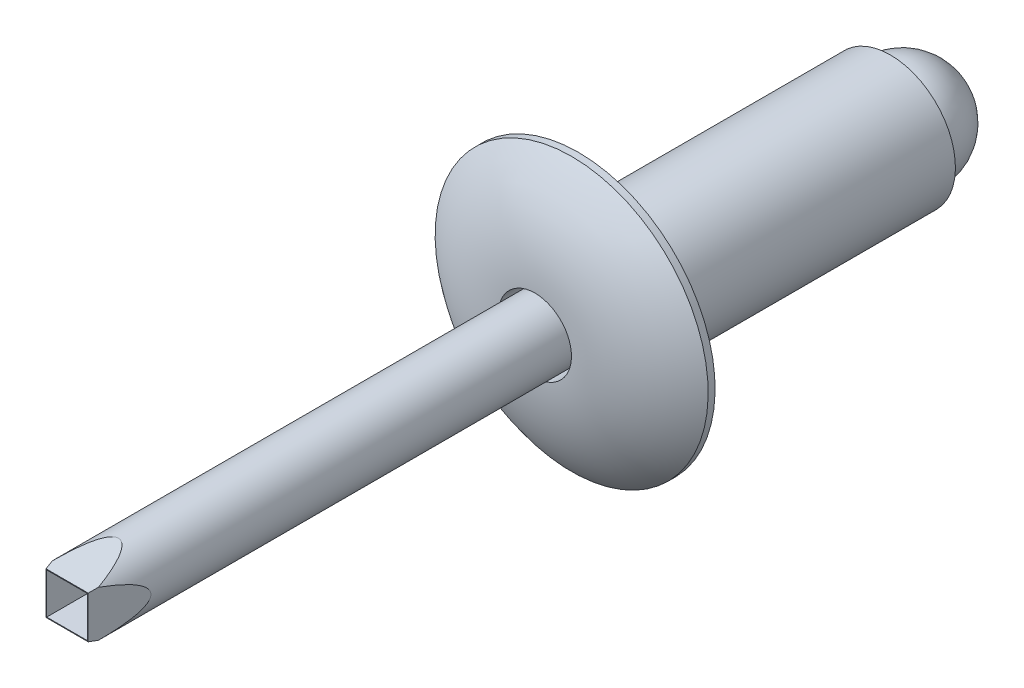
ISO-10303-21;
HEADER;
FILE_DESCRIPTION(('STEP AP214'),'2;1');
FILE_NAME('part.step','',(''),(''),'','','');
FILE_SCHEMA(('AUTOMOTIVE_DESIGN { 1 0 10303 214 1 1 1 1 }'));
ENDSEC;
DATA;
#1=APPLICATION_CONTEXT('core data for automotive mechanical design processes');
#2=APPLICATION_PROTOCOL_DEFINITION('international standard','automotive_design',2000,#1);
#3=PRODUCT_CONTEXT('',#1,'mechanical');
#4=PRODUCT('Part','Part','',(#3));
#5=PRODUCT_RELATED_PRODUCT_CATEGORY('part','',(#4));
#6=PRODUCT_DEFINITION_FORMATION('','',#4);
#7=PRODUCT_DEFINITION_CONTEXT('part definition',#1,'design');
#8=PRODUCT_DEFINITION('design','',#6,#7);
#9=PRODUCT_DEFINITION_SHAPE('','',#8);
#10=(LENGTH_UNIT() NAMED_UNIT(*) SI_UNIT(.MILLI.,.METRE.));
#11=(NAMED_UNIT(*) PLANE_ANGLE_UNIT() SI_UNIT($,.RADIAN.));
#12=(NAMED_UNIT(*) SI_UNIT($,.STERADIAN.) SOLID_ANGLE_UNIT());
#13=UNCERTAINTY_MEASURE_WITH_UNIT(LENGTH_MEASURE(1.E-05),#10,'distance_accuracy_value','');
#14=(GEOMETRIC_REPRESENTATION_CONTEXT(3) GLOBAL_UNCERTAINTY_ASSIGNED_CONTEXT((#13)) GLOBAL_UNIT_ASSIGNED_CONTEXT((#10,
#11,#12)) REPRESENTATION_CONTEXT('',''));
#15=CARTESIAN_POINT('',(0.,0.,0.));
#16=DIRECTION('',(0.,0.,1.));
#17=DIRECTION('',(1.,0.,0.));
#18=AXIS2_PLACEMENT_3D('',#15,#16,#17);
#19=CARTESIAN_POINT('',(0.,0.,-11.8741976190476));
#20=DIRECTION('',(0.,0.,1.));
#21=DIRECTION('',(0.,1.,0.));
#22=AXIS2_PLACEMENT_3D('',#19,#20,#21);
#23=SPHERICAL_SURFACE('',#22,1.95610238095238);
#24=CARTESIAN_POINT('',(0.,0.,-11.43));
#25=DIRECTION('',(0.,0.,1.));
#26=DIRECTION('',(1.,0.,0.));
#27=AXIS2_PLACEMENT_3D('',#24,#25,#26);
#28=CIRCLE('',#27,1.905);
#29=CARTESIAN_POINT('',(1.905,0.,-11.43));
#30=VERTEX_POINT('',#29);
#31=EDGE_CURVE('E11',#30,#30,#28,.T.);
#32=ORIENTED_EDGE('',*,*,#31,.F.);
#33=EDGE_LOOP('',(#32));
#34=FACE_BOUND('',#33,.T.);
#35=ADVANCED_FACE('F51',(#34),#23,.T.);
#36=CARTESIAN_POINT('',(0.,1.905,-11.43));
#37=DIRECTION('',(0.,0.,-1.));
#38=DIRECTION('',(-1.,0.,0.));
#39=AXIS2_PLACEMENT_3D('',#36,#37,#38);
#40=PLANE('',#39);
#41=ORIENTED_EDGE('',*,*,#31,.T.);
#42=EDGE_LOOP('',(#41));
#43=FACE_BOUND('',#42,.T.);
#44=ADVANCED_FACE('F58',(#43),#40,.F.);
#45=CLOSED_SHELL('',(#35,#44));
#46=MANIFOLD_SOLID_BREP('B2',#45);
#47=CARTESIAN_POINT('',(0.,0.,18.7452));
#48=DIRECTION('',(0.,0.,-1.));
#49=DIRECTION('',(-1.,0.,0.));
#50=AXIS2_PLACEMENT_3D('',#47,#48,#49);
#51=PLANE('',#50);
#52=DIRECTION('',(1.,0.,0.));
#53=VECTOR('',#52,1.);
#54=CARTESIAN_POINT('',(-0.74850625,-0.748506249999997,18.7452));
#55=LINE('',#54,#53);
#56=CARTESIAN_POINT('',(-0.74850625,-0.748506249999997,18.7452));
#57=VERTEX_POINT('',#56);
#58=CARTESIAN_POINT('',(0.74850625,-0.748506250000003,18.7452));
#59=VERTEX_POINT('',#58);
#60=EDGE_CURVE('E175',#57,#59,#55,.T.);
#61=ORIENTED_EDGE('',*,*,#60,.F.);
#62=DIRECTION('',(0.,-1.,0.));
#63=VECTOR('',#62,1.);
#64=CARTESIAN_POINT('',(-0.74850625,0.748506250000003,18.7452));
#65=LINE('',#64,#63);
#66=CARTESIAN_POINT('',(-0.74850625,0.748506250000003,18.7452));
#67=VERTEX_POINT('',#66);
#68=EDGE_CURVE('E97',#67,#57,#65,.T.);
#69=ORIENTED_EDGE('',*,*,#68,.F.);
#70=DIRECTION('',(-1.,0.,0.));
#71=VECTOR('',#70,1.);
#72=CARTESIAN_POINT('',(0.74850625,0.748506250000005,18.7452));
#73=LINE('',#72,#71);
#74=CARTESIAN_POINT('',(0.74850625,0.748506250000005,18.7452));
#75=VERTEX_POINT('',#74);
#76=EDGE_CURVE('E166',#75,#67,#73,.T.);
#77=ORIENTED_EDGE('',*,*,#76,.F.);
#78=DIRECTION('',(0.,1.,0.));
#79=VECTOR('',#78,1.);
#80=CARTESIAN_POINT('',(0.74850625,-0.748506250000003,18.7452));
#81=LINE('',#80,#79);
#82=EDGE_CURVE('E169',#59,#75,#81,.T.);
#83=ORIENTED_EDGE('',*,*,#82,.F.);
#84=EDGE_LOOP('',(#61,#69,#77,#83));
#85=FACE_BOUND('',#84,.T.);
#86=DIRECTION('',(0.,1.,0.));
#87=VECTOR('',#86,1.);
#88=CARTESIAN_POINT('',(-0.77390625,-5.0038,18.7452));
#89=LINE('',#88,#87);
#90=CARTESIAN_POINT('',(-0.77390625,-0.773906249999997,18.7452));
#91=VERTEX_POINT('',#90);
#92=CARTESIAN_POINT('',(-0.77390625,0.773906250000003,18.7452));
#93=VERTEX_POINT('',#92);
#94=EDGE_CURVE('E200',#91,#93,#89,.T.);
#95=ORIENTED_EDGE('',*,*,#94,.F.);
#96=DIRECTION('',(1.,0.,0.));
#97=VECTOR('',#96,1.);
#98=CARTESIAN_POINT('',(-1.19062500000001,-0.773906249999996,18.7452));
#99=LINE('',#98,#97);
#100=CARTESIAN_POINT('',(0.77390625,-0.773906250000003,18.7452));
#101=VERTEX_POINT('',#100);
#102=EDGE_CURVE('E181',#91,#101,#99,.T.);
#103=ORIENTED_EDGE('',*,*,#102,.T.);
#104=DIRECTION('',(0.,1.,0.));
#105=VECTOR('',#104,1.);
#106=CARTESIAN_POINT('',(0.77390625,-5.0038,18.7452));
#107=LINE('',#106,#105);
#108=CARTESIAN_POINT('',(0.77390625,0.773906250000005,18.7452));
#109=VERTEX_POINT('',#108);
#110=EDGE_CURVE('E199',#101,#109,#107,.T.);
#111=ORIENTED_EDGE('',*,*,#110,.T.);
#112=DIRECTION('',(1.,0.,0.));
#113=VECTOR('',#112,1.);
#114=CARTESIAN_POINT('',(-1.190625,0.773906250000004,18.7452));
#115=LINE('',#114,#113);
#116=EDGE_CURVE('E185',#93,#109,#115,.T.);
#117=ORIENTED_EDGE('',*,*,#116,.F.);
#118=EDGE_LOOP('',(#95,#103,#111,#117));
#119=FACE_BOUND('',#118,.T.);
#120=ADVANCED_FACE('F83',(#85,#119),#51,.F.);
#121=CARTESIAN_POINT('',(0.,0.,18.7452));
#122=DIRECTION('',(0.,0.,1.));
#123=DIRECTION('',(1.,0.,0.));
#124=AXIS2_PLACEMENT_3D('',#121,#122,#123);
#125=CYLINDRICAL_SURFACE('',#124,1.190625);
#126=CARTESIAN_POINT('',(0.,0.,22.2360655029123));
#127=DIRECTION('',(-0.976296007119934,0.,-0.216439613938101));
#128=DIRECTION('',(-0.216439613938101,0.,0.976296007119934));
#129=AXIS2_PLACEMENT_3D('',#126,#127,#128);
#130=ELLIPSE('',#129,5.50095695670805,1.190625);
#131=CARTESIAN_POINT('',(0.841899011350235,0.841899011350231,18.43850447319));
#132=VERTEX_POINT('',#131);
#133=CARTESIAN_POINT('',(0.841899011350232,-0.841899011350234,18.43850447319));
#134=VERTEX_POINT('',#133);
#135=EDGE_CURVE('E211',#132,#134,#130,.T.);
#136=ORIENTED_EDGE('',*,*,#135,.T.);
#137=CARTESIAN_POINT('',(0.,0.,22.2360655029123));
#138=DIRECTION('',(0.,0.976296007119934,-0.216439613938101));
#139=DIRECTION('',(0.,0.216439613938101,0.976296007119934));
#140=AXIS2_PLACEMENT_3D('',#137,#138,#139);
#141=ELLIPSE('',#140,5.50095695670805,1.190625);
#142=CARTESIAN_POINT('',(-0.841899011350235,-0.841899011350232,18.43850447319));
#143=VERTEX_POINT('',#142);
#144=EDGE_CURVE('E105',#134,#143,#141,.T.);
#145=ORIENTED_EDGE('',*,*,#144,.T.);
#146=CARTESIAN_POINT('',(0.,0.,22.2360655029123));
#147=DIRECTION('',(0.976296007119934,0.,-0.2164396139381));
#148=DIRECTION('',(0.2164396139381,0.,0.976296007119934));
#149=AXIS2_PLACEMENT_3D('',#146,#147,#148);
#150=ELLIPSE('',#149,5.50095695670806,1.190625);
#151=CARTESIAN_POINT('',(-0.841899011350232,0.841899011350234,18.43850447319));
#152=VERTEX_POINT('',#151);
#153=EDGE_CURVE('E208',#143,#152,#150,.T.);
#154=ORIENTED_EDGE('',*,*,#153,.T.);
#155=CARTESIAN_POINT('',(0.,0.,22.2360655029123));
#156=DIRECTION('',(0.,-0.976296007119934,-0.216439613938101));
#157=DIRECTION('',(0.,-0.2164396139381,0.976296007119934));
#158=AXIS2_PLACEMENT_3D('',#155,#156,#157);
#159=ELLIPSE('',#158,5.50095695670806,1.190625);
#160=EDGE_CURVE('E187',#152,#132,#159,.T.);
#161=ORIENTED_EDGE('',*,*,#160,.T.);
#162=EDGE_LOOP('',(#136,#145,#154,#161));
#163=FACE_BOUND('',#162,.T.);
#164=CARTESIAN_POINT('',(0.,0.,-1.143));
#165=DIRECTION('',(0.,0.,1.));
#166=DIRECTION('',(1.,0.,0.));
#167=AXIS2_PLACEMENT_3D('',#164,#165,#166);
#168=CIRCLE('',#167,1.190625);
#169=CARTESIAN_POINT('',(1.190625,0.,-1.143));
#170=VERTEX_POINT('',#169);
#171=EDGE_CURVE('E203',#170,#170,#168,.T.);
#172=ORIENTED_EDGE('',*,*,#171,.T.);
#173=EDGE_LOOP('',(#172));
#174=FACE_BOUND('',#173,.T.);
#175=ADVANCED_FACE('F227',(#163,#174),#125,.T.);
#176=CARTESIAN_POINT('',(0.,1.190625,-1.143));
#177=DIRECTION('',(0.,0.,1.));
#178=DIRECTION('',(1.,0.,0.));
#179=AXIS2_PLACEMENT_3D('',#176,#177,#178);
#180=PLANE('',#179);
#181=ORIENTED_EDGE('',*,*,#171,.F.);
#182=EDGE_LOOP('',(#181));
#183=FACE_BOUND('',#182,.T.);
#184=ADVANCED_FACE('F244',(#183),#180,.F.);
#185=CARTESIAN_POINT('',(-1.393825,-5.0038,15.9489272227954));
#186=DIRECTION('',(0.976296007119934,0.,-0.2164396139381));
#187=DIRECTION('',(-0.2164396139381,0.,-0.976296007119934));
#188=AXIS2_PLACEMENT_3D('',#185,#186,#187);
#189=PLANE('',#188);
#190=ORIENTED_EDGE('',*,*,#153,.F.);
#191=DIRECTION('',(0.211541378239843,0.211541378239843,0.954201493702863));
#192=VECTOR('',#191,1.);
#193=CARTESIAN_POINT('',(-1.55537049575061,-1.55537049575061,15.2202425813848));
#194=LINE('',#193,#192);
#195=EDGE_CURVE('E196',#143,#91,#194,.T.);
#196=ORIENTED_EDGE('',*,*,#195,.T.);
#197=ORIENTED_EDGE('',*,*,#94,.T.);
#198=DIRECTION('',(-0.211541378239843,0.211541378239844,-0.954201493702863));
#199=VECTOR('',#198,1.);
#200=CARTESIAN_POINT('',(-1.10753285053871,1.10753285053871,17.2403076559022));
#201=LINE('',#200,#199);
#202=EDGE_CURVE('E192',#93,#152,#201,.T.);
#203=ORIENTED_EDGE('',*,*,#202,.T.);
#204=EDGE_LOOP('',(#190,#196,#197,#203));
#205=FACE_BOUND('',#204,.T.);
#206=ADVANCED_FACE('F225',(#205),#189,.F.);
#207=CARTESIAN_POINT('',(0.77390625,-5.0038,18.7452));
#208=DIRECTION('',(-0.976296007119934,0.,-0.216439613938101));
#209=DIRECTION('',(-0.216439613938101,0.,0.976296007119934));
#210=AXIS2_PLACEMENT_3D('',#207,#208,#209);
#211=PLANE('',#210);
#212=ORIENTED_EDGE('',*,*,#110,.F.);
#213=DIRECTION('',(0.211541378239843,-0.211541378239844,-0.954201493702863));
#214=VECTOR('',#213,1.);
#215=CARTESIAN_POINT('',(0.963192957751764,-0.963192957751767,17.8913828377139));
#216=LINE('',#215,#214);
#217=EDGE_CURVE('E49',#101,#134,#216,.T.);
#218=ORIENTED_EDGE('',*,*,#217,.T.);
#219=ORIENTED_EDGE('',*,*,#135,.F.);
#220=DIRECTION('',(-0.211541378239843,-0.211541378239842,0.954201493702863));
#221=VECTOR('',#220,1.);
#222=CARTESIAN_POINT('',(0.515355312539862,0.51535531253986,19.9114479122313));
#223=LINE('',#222,#221);
#224=EDGE_CURVE('E90',#132,#109,#223,.T.);
#225=ORIENTED_EDGE('',*,*,#224,.T.);
#226=EDGE_LOOP('',(#212,#218,#219,#225));
#227=FACE_BOUND('',#226,.T.);
#228=ADVANCED_FACE('F217',(#227),#211,.F.);
#229=CARTESIAN_POINT('',(-1.190625,1.393825,15.9489272227954));
#230=DIRECTION('',(0.,-0.976296007119934,-0.216439613938101));
#231=DIRECTION('',(0.,0.216439613938101,-0.976296007119934));
#232=AXIS2_PLACEMENT_3D('',#229,#230,#231);
#233=PLANE('',#232);
#234=ORIENTED_EDGE('',*,*,#116,.T.);
#235=ORIENTED_EDGE('',*,*,#224,.F.);
#236=ORIENTED_EDGE('',*,*,#160,.F.);
#237=ORIENTED_EDGE('',*,*,#202,.F.);
#238=EDGE_LOOP('',(#234,#235,#236,#237));
#239=FACE_BOUND('',#238,.T.);
#240=ADVANCED_FACE('F229',(#239),#233,.F.);
#241=CARTESIAN_POINT('',(-1.19062500000001,-0.773906249999996,18.7452));
#242=DIRECTION('',(0.,0.976296007119934,-0.216439613938101));
#243=DIRECTION('',(0.,0.216439613938101,0.976296007119934));
#244=AXIS2_PLACEMENT_3D('',#241,#242,#243);
#245=PLANE('',#244);
#246=ORIENTED_EDGE('',*,*,#144,.F.);
#247=ORIENTED_EDGE('',*,*,#217,.F.);
#248=ORIENTED_EDGE('',*,*,#102,.F.);
#249=ORIENTED_EDGE('',*,*,#195,.F.);
#250=EDGE_LOOP('',(#246,#247,#248,#249));
#251=FACE_BOUND('',#250,.T.);
#252=ADVANCED_FACE('F222',(#251),#245,.F.);
#253=CARTESIAN_POINT('',(-0.74850625,0.748506250000003,16.2052));
#254=DIRECTION('',(-1.,0.,0.));
#255=DIRECTION('',(0.,0.,1.));
#256=AXIS2_PLACEMENT_3D('',#253,#254,#255);
#257=PLANE('',#256);
#258=ORIENTED_EDGE('',*,*,#68,.T.);
#259=DIRECTION('',(0.,0.,1.));
#260=VECTOR('',#259,1.);
#261=CARTESIAN_POINT('',(-0.74850625,-0.748506249999997,16.2052));
#262=LINE('',#261,#260);
#263=CARTESIAN_POINT('',(-0.74850625,-0.748506249999997,16.2052));
#264=VERTEX_POINT('',#263);
#265=EDGE_CURVE('E144',#264,#57,#262,.T.);
#266=ORIENTED_EDGE('',*,*,#265,.F.);
#267=DIRECTION('',(0.,-1.,0.));
#268=VECTOR('',#267,1.);
#269=CARTESIAN_POINT('',(-0.74850625,0.748506250000003,16.2052));
#270=LINE('',#269,#268);
#271=CARTESIAN_POINT('',(-0.74850625,0.748506250000003,16.2052));
#272=VERTEX_POINT('',#271);
#273=EDGE_CURVE('E148',#272,#264,#270,.T.);
#274=ORIENTED_EDGE('',*,*,#273,.F.);
#275=DIRECTION('',(0.,0.,1.));
#276=VECTOR('',#275,1.);
#277=CARTESIAN_POINT('',(-0.74850625,0.748506250000003,16.2052));
#278=LINE('',#277,#276);
#279=EDGE_CURVE('E179',#272,#67,#278,.T.);
#280=ORIENTED_EDGE('',*,*,#279,.T.);
#281=EDGE_LOOP('',(#258,#266,#274,#280));
#282=FACE_BOUND('',#281,.T.);
#283=ADVANCED_FACE('F146',(#282),#257,.F.);
#284=CARTESIAN_POINT('',(0.74850625,0.748506250000005,16.2052));
#285=DIRECTION('',(0.,1.,0.));
#286=DIRECTION('',(-1.,0.,0.));
#287=AXIS2_PLACEMENT_3D('',#284,#285,#286);
#288=PLANE('',#287);
#289=ORIENTED_EDGE('',*,*,#76,.T.);
#290=ORIENTED_EDGE('',*,*,#279,.F.);
#291=DIRECTION('',(-1.,0.,0.));
#292=VECTOR('',#291,1.);
#293=CARTESIAN_POINT('',(0.74850625,0.748506250000005,16.2052));
#294=LINE('',#293,#292);
#295=CARTESIAN_POINT('',(0.74850625,0.748506250000005,16.2052));
#296=VERTEX_POINT('',#295);
#297=EDGE_CURVE('E154',#296,#272,#294,.T.);
#298=ORIENTED_EDGE('',*,*,#297,.F.);
#299=DIRECTION('',(0.,0.,1.));
#300=VECTOR('',#299,1.);
#301=CARTESIAN_POINT('',(0.74850625,0.748506250000005,16.2052));
#302=LINE('',#301,#300);
#303=EDGE_CURVE('E182',#296,#75,#302,.T.);
#304=ORIENTED_EDGE('',*,*,#303,.T.);
#305=EDGE_LOOP('',(#289,#290,#298,#304));
#306=FACE_BOUND('',#305,.T.);
#307=ADVANCED_FACE('F250',(#306),#288,.F.);
#308=CARTESIAN_POINT('',(0.74850625,-0.748506250000003,16.2052));
#309=DIRECTION('',(1.,0.,0.));
#310=DIRECTION('',(0.,0.,-1.));
#311=AXIS2_PLACEMENT_3D('',#308,#309,#310);
#312=PLANE('',#311);
#313=ORIENTED_EDGE('',*,*,#82,.T.);
#314=ORIENTED_EDGE('',*,*,#303,.F.);
#315=DIRECTION('',(0.,1.,0.));
#316=VECTOR('',#315,1.);
#317=CARTESIAN_POINT('',(0.74850625,-0.748506250000003,16.2052));
#318=LINE('',#317,#316);
#319=CARTESIAN_POINT('',(0.74850625,-0.748506250000003,16.2052));
#320=VERTEX_POINT('',#319);
#321=EDGE_CURVE('E162',#320,#296,#318,.T.);
#322=ORIENTED_EDGE('',*,*,#321,.F.);
#323=DIRECTION('',(0.,0.,1.));
#324=VECTOR('',#323,1.);
#325=CARTESIAN_POINT('',(0.74850625,-0.748506250000003,16.2052));
#326=LINE('',#325,#324);
#327=EDGE_CURVE('E153',#320,#59,#326,.T.);
#328=ORIENTED_EDGE('',*,*,#327,.T.);
#329=EDGE_LOOP('',(#313,#314,#322,#328));
#330=FACE_BOUND('',#329,.T.);
#331=ADVANCED_FACE('F248',(#330),#312,.F.);
#332=CARTESIAN_POINT('',(-0.74850625,-0.748506249999997,16.2052));
#333=DIRECTION('',(0.,-1.,0.));
#334=DIRECTION('',(1.,0.,0.));
#335=AXIS2_PLACEMENT_3D('',#332,#333,#334);
#336=PLANE('',#335);
#337=ORIENTED_EDGE('',*,*,#60,.T.);
#338=ORIENTED_EDGE('',*,*,#327,.F.);
#339=DIRECTION('',(1.,0.,0.));
#340=VECTOR('',#339,1.);
#341=CARTESIAN_POINT('',(-0.74850625,-0.748506249999997,16.2052));
#342=LINE('',#341,#340);
#343=EDGE_CURVE('E157',#264,#320,#342,.T.);
#344=ORIENTED_EDGE('',*,*,#343,.F.);
#345=ORIENTED_EDGE('',*,*,#265,.T.);
#346=EDGE_LOOP('',(#337,#338,#344,#345));
#347=FACE_BOUND('',#346,.T.);
#348=ADVANCED_FACE('F158',(#347),#336,.F.);
#349=CARTESIAN_POINT('',(0.,0.,16.2052));
#350=DIRECTION('',(0.,0.,1.));
#351=DIRECTION('',(1.,0.,0.));
#352=AXIS2_PLACEMENT_3D('',#349,#350,#351);
#353=PLANE('',#352);
#354=ORIENTED_EDGE('',*,*,#273,.T.);
#355=ORIENTED_EDGE('',*,*,#343,.T.);
#356=ORIENTED_EDGE('',*,*,#321,.T.);
#357=ORIENTED_EDGE('',*,*,#297,.T.);
#358=EDGE_LOOP('',(#354,#355,#356,#357));
#359=FACE_BOUND('',#358,.T.);
#360=ADVANCED_FACE('F164',(#359),#353,.T.);
#361=CLOSED_SHELL('',(#120,#175,#184,#206,#228,#240,#252,#283,#307,#331,#348,#360));
#362=MANIFOLD_SOLID_BREP('B6',#361);
#363=CARTESIAN_POINT('',(0.,0.,-11.43));
#364=DIRECTION('',(0.,0.,-1.));
#365=DIRECTION('',(0.,1.,0.));
#366=AXIS2_PLACEMENT_3D('',#363,#364,#365);
#367=CYLINDRICAL_SURFACE('',#366,5.0038);
#368=CARTESIAN_POINT('',(0.,0.,0.254000000000001));
#369=DIRECTION('',(0.,0.,-1.));
#370=DIRECTION('',(0.,1.,0.));
#371=AXIS2_PLACEMENT_3D('',#368,#369,#370);
#372=CIRCLE('',#371,5.0038);
#373=CARTESIAN_POINT('',(0.,5.0038,0.254000000000001));
#374=VERTEX_POINT('',#373);
#375=EDGE_CURVE('E350',#374,#374,#372,.T.);
#376=ORIENTED_EDGE('',*,*,#375,.T.);
#377=EDGE_LOOP('',(#376));
#378=FACE_BOUND('',#377,.T.);
#379=CARTESIAN_POINT('',(0.,0.,0.));
#380=DIRECTION('',(0.,0.,-1.));
#381=DIRECTION('',(0.,1.,0.));
#382=AXIS2_PLACEMENT_3D('',#379,#380,#381);
#383=CIRCLE('',#382,5.0038);
#384=CARTESIAN_POINT('',(0.,5.0038,0.));
#385=VERTEX_POINT('',#384);
#386=EDGE_CURVE('E369',#385,#385,#383,.T.);
#387=ORIENTED_EDGE('',*,*,#386,.F.);
#388=EDGE_LOOP('',(#387));
#389=FACE_BOUND('',#388,.T.);
#390=ADVANCED_FACE('F337',(#378,#389),#367,.T.);
#391=CARTESIAN_POINT('',(0.,0.,-4.06006313338369));
#392=DIRECTION('',(0.,0.,-1.));
#393=DIRECTION('',(0.,1.,0.));
#394=AXIS2_PLACEMENT_3D('',#391,#392,#393);
#395=DEGENERATE_TOROIDAL_SURFACE('',#394,1.339453125,5.66026313338369,.T.);
#396=CARTESIAN_POINT('',(0.,0.,1.6002));
#397=DIRECTION('',(0.,0.,-1.));
#398=DIRECTION('',(0.,1.,0.));
#399=AXIS2_PLACEMENT_3D('',#396,#397,#398);
#400=CIRCLE('',#399,1.339453125);
#401=CARTESIAN_POINT('',(0.,1.339453125,1.6002));
#402=VERTEX_POINT('',#401);
#403=EDGE_CURVE('E355',#402,#402,#400,.T.);
#404=ORIENTED_EDGE('',*,*,#403,.T.);
#405=EDGE_LOOP('',(#404));
#406=FACE_BOUND('',#405,.T.);
#407=ORIENTED_EDGE('',*,*,#375,.F.);
#408=EDGE_LOOP('',(#407));
#409=FACE_BOUND('',#408,.T.);
#410=ADVANCED_FACE('F377',(#406,#409),#395,.T.);
#411=CARTESIAN_POINT('',(0.,0.,-11.43));
#412=DIRECTION('',(0.,0.,-1.));
#413=DIRECTION('',(0.,1.,0.));
#414=AXIS2_PLACEMENT_3D('',#411,#412,#413);
#415=CYLINDRICAL_SURFACE('',#414,1.339453125);
#416=CARTESIAN_POINT('',(0.,0.,-1.143));
#417=DIRECTION('',(0.,0.,-1.));
#418=DIRECTION('',(0.,1.,0.));
#419=AXIS2_PLACEMENT_3D('',#416,#417,#418);
#420=CIRCLE('',#419,1.339453125);
#421=CARTESIAN_POINT('',(0.,1.339453125,-1.143));
#422=VERTEX_POINT('',#421);
#423=EDGE_CURVE('E361',#422,#422,#420,.T.);
#424=ORIENTED_EDGE('',*,*,#423,.T.);
#425=EDGE_LOOP('',(#424));
#426=FACE_BOUND('',#425,.T.);
#427=ORIENTED_EDGE('',*,*,#403,.F.);
#428=EDGE_LOOP('',(#427));
#429=FACE_BOUND('',#428,.T.);
#430=ADVANCED_FACE('F382',(#426,#429),#415,.F.);
#431=CARTESIAN_POINT('',(0.,1.339453125,-1.143));
#432=DIRECTION('',(0.,0.,1.));
#433=DIRECTION('',(0.,-1.,0.));
#434=AXIS2_PLACEMENT_3D('',#431,#432,#433);
#435=PLANE('',#434);
#436=ORIENTED_EDGE('',*,*,#423,.F.);
#437=EDGE_LOOP('',(#436));
#438=FACE_BOUND('',#437,.T.);
#439=ADVANCED_FACE('F388',(#438),#435,.T.);
#440=CARTESIAN_POINT('',(0.,2.38125,-11.43));
#441=DIRECTION('',(0.,0.,-1.));
#442=DIRECTION('',(0.,1.,0.));
#443=AXIS2_PLACEMENT_3D('',#440,#441,#442);
#444=PLANE('',#443);
#445=CARTESIAN_POINT('',(0.,0.,-11.43));
#446=DIRECTION('',(0.,0.,-1.));
#447=DIRECTION('',(0.,1.,0.));
#448=AXIS2_PLACEMENT_3D('',#445,#446,#447);
#449=CIRCLE('',#448,2.38125);
#450=CARTESIAN_POINT('',(0.,2.38125,-11.43));
#451=VERTEX_POINT('',#450);
#452=EDGE_CURVE('E365',#451,#451,#449,.T.);
#453=ORIENTED_EDGE('',*,*,#452,.T.);
#454=EDGE_LOOP('',(#453));
#455=FACE_BOUND('',#454,.T.);
#456=ADVANCED_FACE('F392',(#455),#444,.T.);
#457=CARTESIAN_POINT('',(0.,0.,-11.43));
#458=DIRECTION('',(0.,0.,-1.));
#459=DIRECTION('',(0.,1.,0.));
#460=AXIS2_PLACEMENT_3D('',#457,#458,#459);
#461=CYLINDRICAL_SURFACE('',#460,2.38125);
#462=CARTESIAN_POINT('',(0.,0.,-0.254000000000001));
#463=DIRECTION('',(0.,0.,-1.));
#464=DIRECTION('',(0.,1.,0.));
#465=AXIS2_PLACEMENT_3D('',#462,#463,#464);
#466=CIRCLE('',#465,2.38125);
#467=CARTESIAN_POINT('',(0.,2.38125,-0.254000000000001));
#468=VERTEX_POINT('',#467);
#469=EDGE_CURVE('E345',#468,#468,#466,.T.);
#470=ORIENTED_EDGE('',*,*,#469,.T.);
#471=EDGE_LOOP('',(#470));
#472=FACE_BOUND('',#471,.T.);
#473=ORIENTED_EDGE('',*,*,#452,.F.);
#474=EDGE_LOOP('',(#473));
#475=FACE_BOUND('',#474,.T.);
#476=ADVANCED_FACE('F396',(#472,#475),#461,.T.);
#477=CARTESIAN_POINT('',(0.,2.38125,0.));
#478=DIRECTION('',(0.,0.,-1.));
#479=DIRECTION('',(0.,1.,0.));
#480=AXIS2_PLACEMENT_3D('',#477,#478,#479);
#481=PLANE('',#480);
#482=CARTESIAN_POINT('',(0.,0.,0.));
#483=DIRECTION('',(0.,0.,-1.));
#484=DIRECTION('',(0.,1.,0.));
#485=AXIS2_PLACEMENT_3D('',#482,#483,#484);
#486=CIRCLE('',#485,2.63525);
#487=CARTESIAN_POINT('',(0.,2.63525,0.));
#488=VERTEX_POINT('',#487);
#489=EDGE_CURVE('E82',#488,#488,#486,.F.);
#490=ORIENTED_EDGE('',*,*,#489,.T.);
#491=EDGE_LOOP('',(#490));
#492=FACE_BOUND('',#491,.T.);
#493=ORIENTED_EDGE('',*,*,#386,.T.);
#494=EDGE_LOOP('',(#493));
#495=FACE_BOUND('',#494,.T.);
#496=ADVANCED_FACE('F374',(#492,#495),#481,.T.);
#497=CARTESIAN_POINT('',(0.,0.,-0.254000000000001));
#498=DIRECTION('',(0.,0.,-1.));
#499=DIRECTION('',(0.,1.,0.));
#500=AXIS2_PLACEMENT_3D('',#497,#498,#499);
#501=TOROIDAL_SURFACE('',#500,2.63525,0.254);
#502=ORIENTED_EDGE('',*,*,#489,.F.);
#503=EDGE_LOOP('',(#502));
#504=FACE_BOUND('',#503,.T.);
#505=ORIENTED_EDGE('',*,*,#469,.F.);
#506=EDGE_LOOP('',(#505));
#507=FACE_BOUND('',#506,.T.);
#508=ADVANCED_FACE('F339',(#504,#507),#501,.F.);
#509=CLOSED_SHELL('',(#390,#410,#430,#439,#456,#476,#496,#508));
#510=MANIFOLD_SOLID_BREP('B43',#509);
#511=ADVANCED_BREP_SHAPE_REPRESENTATION('',(#18,#46,#362,#510),#14);
#512=SHAPE_DEFINITION_REPRESENTATION(#9,#511);
ENDSEC;
END-ISO-10303-21;
